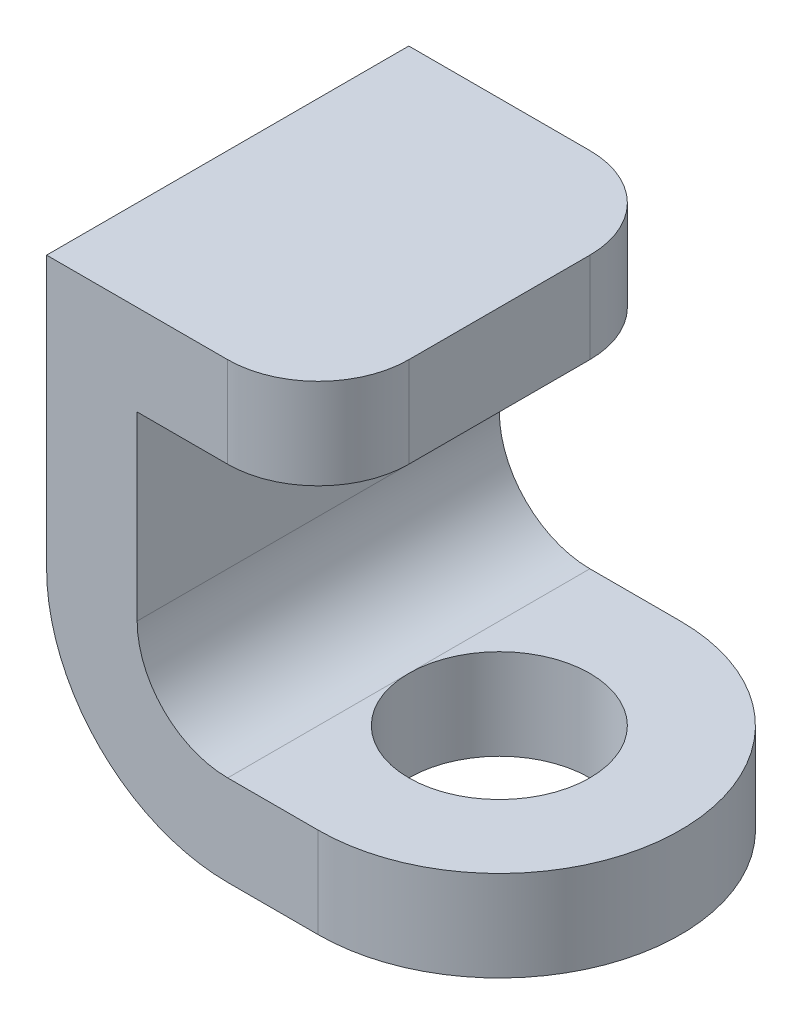
ISO-10303-21;
HEADER;
FILE_DESCRIPTION(('STEP AP214'),'2;1');
FILE_NAME('part.step','',(''),(''),'','','');
FILE_SCHEMA(('AUTOMOTIVE_DESIGN { 1 0 10303 214 1 1 1 1 }'));
ENDSEC;
DATA;
#1=APPLICATION_CONTEXT('core data for automotive mechanical design processes');
#2=APPLICATION_PROTOCOL_DEFINITION('international standard','automotive_design',2000,#1);
#3=PRODUCT_CONTEXT('',#1,'mechanical');
#4=PRODUCT('Part','Part','',(#3));
#5=PRODUCT_RELATED_PRODUCT_CATEGORY('part','',(#4));
#6=PRODUCT_DEFINITION_FORMATION('','',#4);
#7=PRODUCT_DEFINITION_CONTEXT('part definition',#1,'design');
#8=PRODUCT_DEFINITION('design','',#6,#7);
#9=PRODUCT_DEFINITION_SHAPE('','',#8);
#10=(LENGTH_UNIT() NAMED_UNIT(*) SI_UNIT(.MILLI.,.METRE.));
#11=(NAMED_UNIT(*) PLANE_ANGLE_UNIT() SI_UNIT($,.RADIAN.));
#12=(NAMED_UNIT(*) SI_UNIT($,.STERADIAN.) SOLID_ANGLE_UNIT());
#13=UNCERTAINTY_MEASURE_WITH_UNIT(LENGTH_MEASURE(1.E-05),#10,'distance_accuracy_value','');
#14=(GEOMETRIC_REPRESENTATION_CONTEXT(3) GLOBAL_UNCERTAINTY_ASSIGNED_CONTEXT((#13)) GLOBAL_UNIT_ASSIGNED_CONTEXT((#10,
#11,#12)) REPRESENTATION_CONTEXT('',''));
#15=CARTESIAN_POINT('',(0.,0.,0.));
#16=DIRECTION('',(0.,0.,1.));
#17=DIRECTION('',(1.,0.,0.));
#18=AXIS2_PLACEMENT_3D('',#15,#16,#17);
#19=CARTESIAN_POINT('',(-2.,5.,0.));
#20=DIRECTION('',(-1.,0.,0.));
#21=DIRECTION('',(0.,0.,1.));
#22=AXIS2_PLACEMENT_3D('',#19,#20,#21);
#23=PLANE('',#22);
#24=DIRECTION('',(0.,-1.,0.));
#25=VECTOR('',#24,1.);
#26=CARTESIAN_POINT('',(-2.,5.,2.));
#27=LINE('',#26,#25);
#28=CARTESIAN_POINT('',(-2.,4.,2.));
#29=VERTEX_POINT('',#28);
#30=CARTESIAN_POINT('',(-2.,2.,2.));
#31=VERTEX_POINT('',#30);
#32=EDGE_CURVE('E147',#29,#31,#27,.T.);
#33=ORIENTED_EDGE('',*,*,#32,.T.);
#34=DIRECTION('',(0.,0.,-1.));
#35=VECTOR('',#34,1.);
#36=CARTESIAN_POINT('',(-2.,2.,0.));
#37=LINE('',#36,#35);
#38=CARTESIAN_POINT('',(-2.,2.,-2.));
#39=VERTEX_POINT('',#38);
#40=EDGE_CURVE('E213',#31,#39,#37,.T.);
#41=ORIENTED_EDGE('',*,*,#40,.T.);
#42=DIRECTION('',(0.,-1.,0.));
#43=VECTOR('',#42,1.);
#44=CARTESIAN_POINT('',(-2.,5.,-2.));
#45=LINE('',#44,#43);
#46=CARTESIAN_POINT('',(-2.,4.,-2.));
#47=VERTEX_POINT('',#46);
#48=EDGE_CURVE('E149',#47,#39,#45,.T.);
#49=ORIENTED_EDGE('',*,*,#48,.F.);
#50=DIRECTION('',(0.,0.,-1.));
#51=VECTOR('',#50,1.);
#52=CARTESIAN_POINT('',(-2.,4.,2.));
#53=LINE('',#52,#51);
#54=EDGE_CURVE('E134',#29,#47,#53,.T.);
#55=ORIENTED_EDGE('',*,*,#54,.F.);
#56=EDGE_LOOP('',(#33,#41,#49,#55));
#57=FACE_BOUND('',#56,.T.);
#58=ADVANCED_FACE('F35',(#57),#23,.F.);
#59=CARTESIAN_POINT('',(0.,1.,2.));
#60=DIRECTION('',(0.,0.,-1.));
#61=DIRECTION('',(-1.,0.,0.));
#62=AXIS2_PLACEMENT_3D('',#59,#60,#61);
#63=PLANE('',#62);
#64=DIRECTION('',(0.,-1.,0.));
#65=VECTOR('',#64,1.);
#66=CARTESIAN_POINT('',(-3.,5.,2.));
#67=LINE('',#66,#65);
#68=CARTESIAN_POINT('',(-3.,5.,2.));
#69=VERTEX_POINT('',#68);
#70=CARTESIAN_POINT('',(-3.,2.,2.));
#71=VERTEX_POINT('',#70);
#72=EDGE_CURVE('E247',#69,#71,#67,.T.);
#73=ORIENTED_EDGE('',*,*,#72,.T.);
#74=CARTESIAN_POINT('',(-1.,2.,2.));
#75=DIRECTION('',(0.,0.,-1.));
#76=DIRECTION('',(-1.,0.,0.));
#77=AXIS2_PLACEMENT_3D('',#74,#75,#76);
#78=CIRCLE('',#77,2.);
#79=CARTESIAN_POINT('',(-1.,0.,2.));
#80=VERTEX_POINT('',#79);
#81=EDGE_CURVE('E205',#71,#80,#78,.F.);
#82=ORIENTED_EDGE('',*,*,#81,.T.);
#83=DIRECTION('',(1.,0.,0.));
#84=VECTOR('',#83,1.);
#85=CARTESIAN_POINT('',(0.,0.,2.));
#86=LINE('',#85,#84);
#87=CARTESIAN_POINT('',(0.,0.,2.));
#88=VERTEX_POINT('',#87);
#89=EDGE_CURVE('E158',#80,#88,#86,.T.);
#90=ORIENTED_EDGE('',*,*,#89,.T.);
#91=DIRECTION('',(0.,-1.,0.));
#92=VECTOR('',#91,1.);
#93=CARTESIAN_POINT('',(0.,1.,2.));
#94=LINE('',#93,#92);
#95=CARTESIAN_POINT('',(0.,1.,2.));
#96=VERTEX_POINT('',#95);
#97=EDGE_CURVE('E182',#96,#88,#94,.T.);
#98=ORIENTED_EDGE('',*,*,#97,.F.);
#99=DIRECTION('',(1.,0.,0.));
#100=VECTOR('',#99,1.);
#101=CARTESIAN_POINT('',(0.,1.,2.));
#102=LINE('',#101,#100);
#103=CARTESIAN_POINT('',(-0.999999999999999,1.,2.));
#104=VERTEX_POINT('',#103);
#105=EDGE_CURVE('E167',#104,#96,#102,.T.);
#106=ORIENTED_EDGE('',*,*,#105,.F.);
#107=CARTESIAN_POINT('',(-0.999999999999999,2.,2.));
#108=DIRECTION('',(0.,0.,-1.));
#109=DIRECTION('',(-1.,0.,0.));
#110=AXIS2_PLACEMENT_3D('',#107,#108,#109);
#111=CIRCLE('',#110,1.);
#112=EDGE_CURVE('E11',#104,#31,#111,.T.);
#113=ORIENTED_EDGE('',*,*,#112,.T.);
#114=ORIENTED_EDGE('',*,*,#32,.F.);
#115=DIRECTION('',(-1.,0.,0.));
#116=VECTOR('',#115,1.);
#117=CARTESIAN_POINT('',(0.,4.,2.));
#118=LINE('',#117,#116);
#119=CARTESIAN_POINT('',(-0.999999999999999,4.,2.));
#120=VERTEX_POINT('',#119);
#121=EDGE_CURVE('E130',#120,#29,#118,.T.);
#122=ORIENTED_EDGE('',*,*,#121,.F.);
#123=DIRECTION('',(0.,-1.,0.));
#124=VECTOR('',#123,1.);
#125=CARTESIAN_POINT('',(-0.999999999999999,5.,2.));
#126=LINE('',#125,#124);
#127=CARTESIAN_POINT('',(-0.999999999999999,5.,2.));
#128=VERTEX_POINT('',#127);
#129=EDGE_CURVE('E200',#120,#128,#126,.F.);
#130=ORIENTED_EDGE('',*,*,#129,.T.);
#131=DIRECTION('',(1.,0.,0.));
#132=VECTOR('',#131,1.);
#133=CARTESIAN_POINT('',(0.,5.,2.));
#134=LINE('',#133,#132);
#135=EDGE_CURVE('E141',#69,#128,#134,.T.);
#136=ORIENTED_EDGE('',*,*,#135,.F.);
#137=EDGE_LOOP('',(#73,#82,#90,#98,#106,#113,#114,#122,#130,#136));
#138=FACE_BOUND('',#137,.T.);
#139=ADVANCED_FACE('F153',(#138),#63,.F.);
#140=CARTESIAN_POINT('',(0.,1.,0.));
#141=DIRECTION('',(0.,-1.,0.));
#142=DIRECTION('',(0.,0.,-1.));
#143=AXIS2_PLACEMENT_3D('',#140,#141,#142);
#144=CYLINDRICAL_SURFACE('',#143,2.);
#145=CARTESIAN_POINT('',(0.,0.,0.));
#146=DIRECTION('',(0.,1.,0.));
#147=DIRECTION('',(0.,0.,1.));
#148=AXIS2_PLACEMENT_3D('',#145,#146,#147);
#149=CIRCLE('',#148,2.);
#150=CARTESIAN_POINT('',(0.,0.,-2.));
#151=VERTEX_POINT('',#150);
#152=EDGE_CURVE('E176',#88,#151,#149,.T.);
#153=ORIENTED_EDGE('',*,*,#152,.T.);
#154=DIRECTION('',(0.,-1.,0.));
#155=VECTOR('',#154,1.);
#156=CARTESIAN_POINT('',(0.,1.,-2.));
#157=LINE('',#156,#155);
#158=CARTESIAN_POINT('',(0.,1.,-2.));
#159=VERTEX_POINT('',#158);
#160=EDGE_CURVE('E173',#159,#151,#157,.T.);
#161=ORIENTED_EDGE('',*,*,#160,.F.);
#162=CARTESIAN_POINT('',(0.,1.,0.));
#163=DIRECTION('',(0.,1.,0.));
#164=DIRECTION('',(0.,0.,1.));
#165=AXIS2_PLACEMENT_3D('',#162,#163,#164);
#166=CIRCLE('',#165,2.);
#167=EDGE_CURVE('E170',#96,#159,#166,.T.);
#168=ORIENTED_EDGE('',*,*,#167,.F.);
#169=ORIENTED_EDGE('',*,*,#97,.T.);
#170=EDGE_LOOP('',(#153,#161,#168,#169));
#171=FACE_BOUND('',#170,.T.);
#172=ADVANCED_FACE('F243',(#171),#144,.T.);
#173=CARTESIAN_POINT('',(0.,1.,-2.));
#174=DIRECTION('',(0.,0.,1.));
#175=DIRECTION('',(1.,0.,0.));
#176=AXIS2_PLACEMENT_3D('',#173,#174,#175);
#177=PLANE('',#176);
#178=DIRECTION('',(-1.,0.,0.));
#179=VECTOR('',#178,1.);
#180=CARTESIAN_POINT('',(0.,0.,-2.));
#181=LINE('',#180,#179);
#182=CARTESIAN_POINT('',(-1.,0.,-2.));
#183=VERTEX_POINT('',#182);
#184=EDGE_CURVE('E168',#151,#183,#181,.T.);
#185=ORIENTED_EDGE('',*,*,#184,.T.);
#186=CARTESIAN_POINT('',(-1.,2.,-2.));
#187=DIRECTION('',(0.,0.,1.));
#188=DIRECTION('',(1.,0.,0.));
#189=AXIS2_PLACEMENT_3D('',#186,#187,#188);
#190=CIRCLE('',#189,2.);
#191=CARTESIAN_POINT('',(-3.,2.,-2.));
#192=VERTEX_POINT('',#191);
#193=EDGE_CURVE('E211',#183,#192,#190,.F.);
#194=ORIENTED_EDGE('',*,*,#193,.T.);
#195=DIRECTION('',(0.,-1.,0.));
#196=VECTOR('',#195,1.);
#197=CARTESIAN_POINT('',(-3.,5.,-2.));
#198=LINE('',#197,#196);
#199=CARTESIAN_POINT('',(-3.,5.,-2.));
#200=VERTEX_POINT('',#199);
#201=EDGE_CURVE('E160',#200,#192,#198,.T.);
#202=ORIENTED_EDGE('',*,*,#201,.F.);
#203=DIRECTION('',(-1.,0.,0.));
#204=VECTOR('',#203,1.);
#205=CARTESIAN_POINT('',(0.,5.,-2.));
#206=LINE('',#205,#204);
#207=CARTESIAN_POINT('',(-0.999999999999999,5.,-2.));
#208=VERTEX_POINT('',#207);
#209=EDGE_CURVE('E256',#208,#200,#206,.T.);
#210=ORIENTED_EDGE('',*,*,#209,.F.);
#211=DIRECTION('',(0.,1.,0.));
#212=VECTOR('',#211,1.);
#213=CARTESIAN_POINT('',(-0.999999999999999,4.,-2.));
#214=LINE('',#213,#212);
#215=CARTESIAN_POINT('',(-0.999999999999999,4.,-2.));
#216=VERTEX_POINT('',#215);
#217=EDGE_CURVE('E195',#208,#216,#214,.F.);
#218=ORIENTED_EDGE('',*,*,#217,.T.);
#219=DIRECTION('',(-1.,0.,0.));
#220=VECTOR('',#219,1.);
#221=CARTESIAN_POINT('',(0.,4.,-2.));
#222=LINE('',#221,#220);
#223=EDGE_CURVE('E142',#216,#47,#222,.T.);
#224=ORIENTED_EDGE('',*,*,#223,.T.);
#225=ORIENTED_EDGE('',*,*,#48,.T.);
#226=CARTESIAN_POINT('',(-0.999999999999999,2.,-2.));
#227=DIRECTION('',(0.,0.,1.));
#228=DIRECTION('',(1.,0.,0.));
#229=AXIS2_PLACEMENT_3D('',#226,#227,#228);
#230=CIRCLE('',#229,1.);
#231=CARTESIAN_POINT('',(-0.999999999999999,1.,-2.));
#232=VERTEX_POINT('',#231);
#233=EDGE_CURVE('E43',#39,#232,#230,.T.);
#234=ORIENTED_EDGE('',*,*,#233,.T.);
#235=DIRECTION('',(-1.,0.,0.));
#236=VECTOR('',#235,1.);
#237=CARTESIAN_POINT('',(0.,1.,-2.));
#238=LINE('',#237,#236);
#239=EDGE_CURVE('E172',#159,#232,#238,.T.);
#240=ORIENTED_EDGE('',*,*,#239,.F.);
#241=ORIENTED_EDGE('',*,*,#160,.T.);
#242=EDGE_LOOP('',(#185,#194,#202,#210,#218,#224,#225,#234,#240,#241));
#243=FACE_BOUND('',#242,.T.);
#244=ADVANCED_FACE('F224',(#243),#177,.F.);
#245=CARTESIAN_POINT('',(0.,1.,0.));
#246=DIRECTION('',(0.,-1.,0.));
#247=DIRECTION('',(0.,0.,-1.));
#248=AXIS2_PLACEMENT_3D('',#245,#246,#247);
#249=CYLINDRICAL_SURFACE('',#248,1.);
#250=CARTESIAN_POINT('',(0.,1.,0.));
#251=DIRECTION('',(0.,1.,0.));
#252=DIRECTION('',(0.,0.,1.));
#253=AXIS2_PLACEMENT_3D('',#250,#251,#252);
#254=CIRCLE('',#253,1.);
#255=CARTESIAN_POINT('',(-0.999999999999999,1.,0.));
#256=VERTEX_POINT('',#255);
#257=EDGE_CURVE('E164',#256,#256,#254,.T.);
#258=ORIENTED_EDGE('',*,*,#257,.T.);
#259=EDGE_LOOP('',(#258));
#260=FACE_BOUND('',#259,.T.);
#261=CARTESIAN_POINT('',(0.,0.,0.));
#262=DIRECTION('',(0.,1.,0.));
#263=DIRECTION('',(0.,0.,1.));
#264=AXIS2_PLACEMENT_3D('',#261,#262,#263);
#265=CIRCLE('',#264,1.);
#266=CARTESIAN_POINT('',(-1.,0.,0.));
#267=VERTEX_POINT('',#266);
#268=EDGE_CURVE('E155',#267,#267,#265,.T.);
#269=ORIENTED_EDGE('',*,*,#268,.F.);
#270=EDGE_LOOP('',(#269));
#271=FACE_BOUND('',#270,.T.);
#272=ADVANCED_FACE('F221',(#260,#271),#249,.F.);
#273=CARTESIAN_POINT('',(0.,1.,0.));
#274=DIRECTION('',(0.,1.,0.));
#275=DIRECTION('',(0.,0.,1.));
#276=AXIS2_PLACEMENT_3D('',#273,#274,#275);
#277=PLANE('',#276);
#278=ORIENTED_EDGE('',*,*,#239,.T.);
#279=DIRECTION('',(0.,0.,-1.));
#280=VECTOR('',#279,1.);
#281=CARTESIAN_POINT('',(-0.999999999999999,1.,0.));
#282=LINE('',#281,#280);
#283=EDGE_CURVE('E216',#232,#256,#282,.F.);
#284=ORIENTED_EDGE('',*,*,#283,.T.);
#285=ORIENTED_EDGE('',*,*,#257,.F.);
#286=DIRECTION('',(0.,0.,-1.));
#287=VECTOR('',#286,1.);
#288=CARTESIAN_POINT('',(-0.999999999999999,1.,0.));
#289=LINE('',#288,#287);
#290=EDGE_CURVE('E57',#256,#104,#289,.F.);
#291=ORIENTED_EDGE('',*,*,#290,.T.);
#292=ORIENTED_EDGE('',*,*,#105,.T.);
#293=ORIENTED_EDGE('',*,*,#167,.T.);
#294=EDGE_LOOP('',(#278,#284,#285,#291,#292,#293));
#295=FACE_BOUND('',#294,.T.);
#296=ADVANCED_FACE('F218',(#295),#277,.T.);
#297=CARTESIAN_POINT('',(0.,0.,0.));
#298=DIRECTION('',(0.,1.,0.));
#299=DIRECTION('',(0.,0.,1.));
#300=AXIS2_PLACEMENT_3D('',#297,#298,#299);
#301=PLANE('',#300);
#302=ORIENTED_EDGE('',*,*,#89,.F.);
#303=DIRECTION('',(0.,0.,1.));
#304=VECTOR('',#303,1.);
#305=CARTESIAN_POINT('',(-1.,0.,0.));
#306=LINE('',#305,#304);
#307=EDGE_CURVE('E209',#80,#267,#306,.F.);
#308=ORIENTED_EDGE('',*,*,#307,.T.);
#309=ORIENTED_EDGE('',*,*,#268,.T.);
#310=DIRECTION('',(0.,0.,1.));
#311=VECTOR('',#310,1.);
#312=CARTESIAN_POINT('',(-1.,0.,0.));
#313=LINE('',#312,#311);
#314=EDGE_CURVE('E207',#267,#183,#313,.F.);
#315=ORIENTED_EDGE('',*,*,#314,.T.);
#316=ORIENTED_EDGE('',*,*,#184,.F.);
#317=ORIENTED_EDGE('',*,*,#152,.F.);
#318=EDGE_LOOP('',(#302,#308,#309,#315,#316,#317));
#319=FACE_BOUND('',#318,.T.);
#320=ADVANCED_FACE('F236',(#319),#301,.F.);
#321=CARTESIAN_POINT('',(-3.,5.,0.));
#322=DIRECTION('',(1.,0.,0.));
#323=DIRECTION('',(0.,0.,-1.));
#324=AXIS2_PLACEMENT_3D('',#321,#322,#323);
#325=PLANE('',#324);
#326=ORIENTED_EDGE('',*,*,#201,.T.);
#327=DIRECTION('',(0.,0.,1.));
#328=VECTOR('',#327,1.);
#329=CARTESIAN_POINT('',(-3.,2.,0.));
#330=LINE('',#329,#328);
#331=EDGE_CURVE('E202',#192,#71,#330,.T.);
#332=ORIENTED_EDGE('',*,*,#331,.T.);
#333=ORIENTED_EDGE('',*,*,#72,.F.);
#334=DIRECTION('',(0.,0.,1.));
#335=VECTOR('',#334,1.);
#336=CARTESIAN_POINT('',(-3.,5.,0.));
#337=LINE('',#336,#335);
#338=EDGE_CURVE('E251',#200,#69,#337,.T.);
#339=ORIENTED_EDGE('',*,*,#338,.F.);
#340=EDGE_LOOP('',(#326,#332,#333,#339));
#341=FACE_BOUND('',#340,.T.);
#342=ADVANCED_FACE('F249',(#341),#325,.F.);
#343=CARTESIAN_POINT('',(0.,5.,0.));
#344=DIRECTION('',(0.,1.,0.));
#345=DIRECTION('',(0.,0.,1.));
#346=AXIS2_PLACEMENT_3D('',#343,#344,#345);
#347=PLANE('',#346);
#348=DIRECTION('',(0.,0.,1.));
#349=VECTOR('',#348,1.);
#350=CARTESIAN_POINT('',(0.,5.,2.));
#351=LINE('',#350,#349);
#352=CARTESIAN_POINT('',(0.,5.,-1.));
#353=VERTEX_POINT('',#352);
#354=CARTESIAN_POINT('',(0.,5.,1.));
#355=VERTEX_POINT('',#354);
#356=EDGE_CURVE('E260',#353,#355,#351,.T.);
#357=ORIENTED_EDGE('',*,*,#356,.F.);
#358=CARTESIAN_POINT('',(-0.999999999999999,5.,-1.));
#359=DIRECTION('',(0.,1.,0.));
#360=DIRECTION('',(0.,0.,1.));
#361=AXIS2_PLACEMENT_3D('',#358,#359,#360);
#362=CIRCLE('',#361,1.);
#363=EDGE_CURVE('E193',#353,#208,#362,.T.);
#364=ORIENTED_EDGE('',*,*,#363,.T.);
#365=ORIENTED_EDGE('',*,*,#209,.T.);
#366=ORIENTED_EDGE('',*,*,#338,.T.);
#367=ORIENTED_EDGE('',*,*,#135,.T.);
#368=CARTESIAN_POINT('',(-0.999999999999999,5.,1.));
#369=DIRECTION('',(0.,1.,0.));
#370=DIRECTION('',(0.,0.,1.));
#371=AXIS2_PLACEMENT_3D('',#368,#369,#370);
#372=CIRCLE('',#371,1.);
#373=EDGE_CURVE('E191',#128,#355,#372,.T.);
#374=ORIENTED_EDGE('',*,*,#373,.T.);
#375=EDGE_LOOP('',(#357,#364,#365,#366,#367,#374));
#376=FACE_BOUND('',#375,.T.);
#377=ADVANCED_FACE('F275',(#376),#347,.T.);
#378=CARTESIAN_POINT('',(0.,4.,2.));
#379=DIRECTION('',(0.,1.,0.));
#380=DIRECTION('',(0.,0.,1.));
#381=AXIS2_PLACEMENT_3D('',#378,#379,#380);
#382=PLANE('',#381);
#383=ORIENTED_EDGE('',*,*,#223,.F.);
#384=CARTESIAN_POINT('',(-0.999999999999999,4.,-1.));
#385=DIRECTION('',(0.,1.,0.));
#386=DIRECTION('',(0.,0.,1.));
#387=AXIS2_PLACEMENT_3D('',#384,#385,#386);
#388=CIRCLE('',#387,1.);
#389=CARTESIAN_POINT('',(0.,4.,-1.));
#390=VERTEX_POINT('',#389);
#391=EDGE_CURVE('E198',#216,#390,#388,.F.);
#392=ORIENTED_EDGE('',*,*,#391,.T.);
#393=DIRECTION('',(0.,0.,-1.));
#394=VECTOR('',#393,1.);
#395=CARTESIAN_POINT('',(0.,4.,2.));
#396=LINE('',#395,#394);
#397=CARTESIAN_POINT('',(0.,4.,1.));
#398=VERTEX_POINT('',#397);
#399=EDGE_CURVE('E150',#398,#390,#396,.T.);
#400=ORIENTED_EDGE('',*,*,#399,.F.);
#401=CARTESIAN_POINT('',(-0.999999999999999,4.,1.));
#402=DIRECTION('',(0.,1.,0.));
#403=DIRECTION('',(0.,0.,1.));
#404=AXIS2_PLACEMENT_3D('',#401,#402,#403);
#405=CIRCLE('',#404,1.);
#406=EDGE_CURVE('E137',#398,#120,#405,.F.);
#407=ORIENTED_EDGE('',*,*,#406,.T.);
#408=ORIENTED_EDGE('',*,*,#121,.T.);
#409=ORIENTED_EDGE('',*,*,#54,.T.);
#410=EDGE_LOOP('',(#383,#392,#400,#407,#408,#409));
#411=FACE_BOUND('',#410,.T.);
#412=ADVANCED_FACE('F133',(#411),#382,.F.);
#413=CARTESIAN_POINT('',(0.,0.,0.));
#414=DIRECTION('',(1.,0.,0.));
#415=DIRECTION('',(0.,0.,-1.));
#416=AXIS2_PLACEMENT_3D('',#413,#414,#415);
#417=PLANE('',#416);
#418=ORIENTED_EDGE('',*,*,#399,.T.);
#419=DIRECTION('',(0.,1.,0.));
#420=VECTOR('',#419,1.);
#421=CARTESIAN_POINT('',(0.,5.,-1.));
#422=LINE('',#421,#420);
#423=EDGE_CURVE('E188',#390,#353,#422,.T.);
#424=ORIENTED_EDGE('',*,*,#423,.T.);
#425=ORIENTED_EDGE('',*,*,#356,.T.);
#426=DIRECTION('',(0.,-1.,0.));
#427=VECTOR('',#426,1.);
#428=CARTESIAN_POINT('',(0.,4.,1.));
#429=LINE('',#428,#427);
#430=EDGE_CURVE('E185',#355,#398,#429,.T.);
#431=ORIENTED_EDGE('',*,*,#430,.T.);
#432=EDGE_LOOP('',(#418,#424,#425,#431));
#433=FACE_BOUND('',#432,.T.);
#434=ADVANCED_FACE('F267',(#433),#417,.T.);
#435=CARTESIAN_POINT('',(-0.999999999999999,0.,-1.));
#436=DIRECTION('',(0.,-1.,0.));
#437=DIRECTION('',(0.,0.,-1.));
#438=AXIS2_PLACEMENT_3D('',#435,#436,#437);
#439=CYLINDRICAL_SURFACE('',#438,1.);
#440=ORIENTED_EDGE('',*,*,#391,.F.);
#441=ORIENTED_EDGE('',*,*,#217,.F.);
#442=ORIENTED_EDGE('',*,*,#363,.F.);
#443=ORIENTED_EDGE('',*,*,#423,.F.);
#444=EDGE_LOOP('',(#440,#441,#442,#443));
#445=FACE_BOUND('',#444,.T.);
#446=ADVANCED_FACE('F272',(#445),#439,.T.);
#447=CARTESIAN_POINT('',(-0.999999999999999,0.,1.));
#448=DIRECTION('',(0.,1.,0.));
#449=DIRECTION('',(0.,0.,1.));
#450=AXIS2_PLACEMENT_3D('',#447,#448,#449);
#451=CYLINDRICAL_SURFACE('',#450,1.);
#452=ORIENTED_EDGE('',*,*,#373,.F.);
#453=ORIENTED_EDGE('',*,*,#129,.F.);
#454=ORIENTED_EDGE('',*,*,#406,.F.);
#455=ORIENTED_EDGE('',*,*,#430,.F.);
#456=EDGE_LOOP('',(#452,#453,#454,#455));
#457=FACE_BOUND('',#456,.T.);
#458=ADVANCED_FACE('F278',(#457),#451,.T.);
#459=CARTESIAN_POINT('',(-1.,2.,0.));
#460=DIRECTION('',(0.,0.,1.));
#461=DIRECTION('',(1.,0.,0.));
#462=AXIS2_PLACEMENT_3D('',#459,#460,#461);
#463=CYLINDRICAL_SURFACE('',#462,2.);
#464=ORIENTED_EDGE('',*,*,#314,.F.);
#465=ORIENTED_EDGE('',*,*,#307,.F.);
#466=ORIENTED_EDGE('',*,*,#81,.F.);
#467=ORIENTED_EDGE('',*,*,#331,.F.);
#468=ORIENTED_EDGE('',*,*,#193,.F.);
#469=EDGE_LOOP('',(#464,#465,#466,#467,#468));
#470=FACE_BOUND('',#469,.T.);
#471=ADVANCED_FACE('F232',(#470),#463,.T.);
#472=CARTESIAN_POINT('',(-0.999999999999999,2.,0.));
#473=DIRECTION('',(0.,0.,-1.));
#474=DIRECTION('',(-1.,0.,0.));
#475=AXIS2_PLACEMENT_3D('',#472,#473,#474);
#476=CYLINDRICAL_SURFACE('',#475,1.);
#477=ORIENTED_EDGE('',*,*,#290,.F.);
#478=ORIENTED_EDGE('',*,*,#283,.F.);
#479=ORIENTED_EDGE('',*,*,#233,.F.);
#480=ORIENTED_EDGE('',*,*,#40,.F.);
#481=ORIENTED_EDGE('',*,*,#112,.F.);
#482=EDGE_LOOP('',(#477,#478,#479,#480,#481));
#483=FACE_BOUND('',#482,.T.);
#484=ADVANCED_FACE('F37',(#483),#476,.F.);
#485=CLOSED_SHELL('',(#58,#139,#172,#244,#272,#296,#320,#342,#377,#412,#434,#446,#458,#471,#484));
#486=MANIFOLD_SOLID_BREP('B2',#485);
#487=ADVANCED_BREP_SHAPE_REPRESENTATION('',(#18,#486),#14);
#488=SHAPE_DEFINITION_REPRESENTATION(#9,#487);
ENDSEC;
END-ISO-10303-21;
